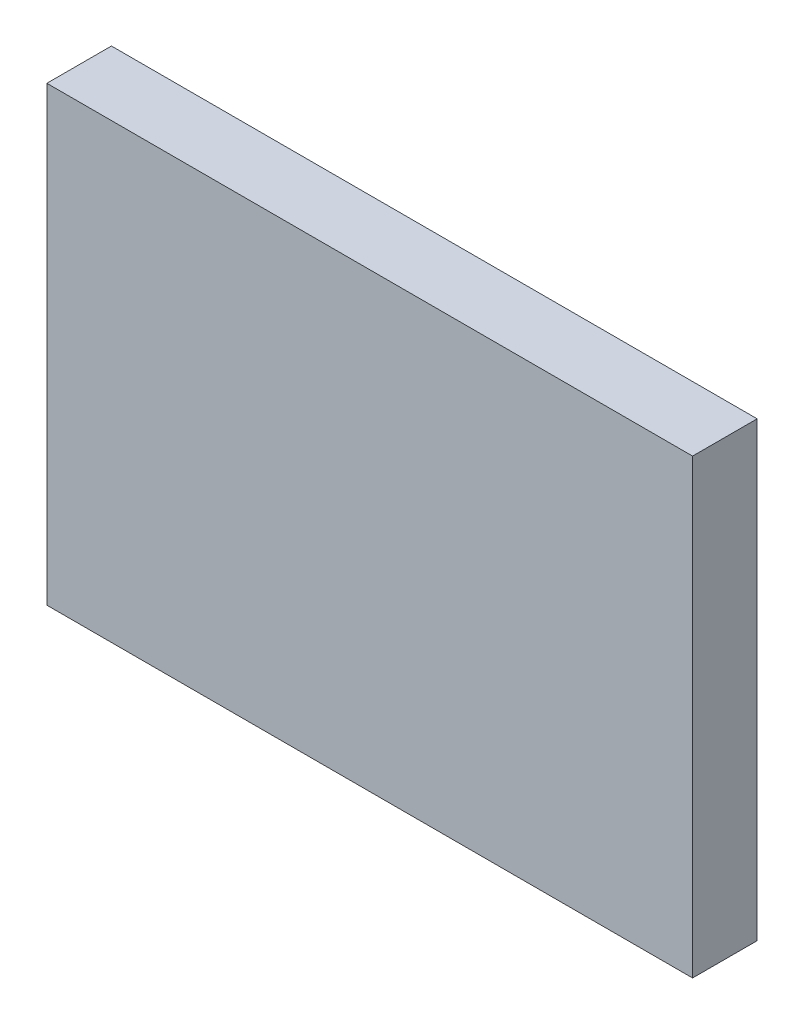
ISO-10303-21;
HEADER;
FILE_DESCRIPTION(('STEP AP214'),'2;1');
FILE_NAME('part.step','',(''),(''),'','','');
FILE_SCHEMA(('AUTOMOTIVE_DESIGN { 1 0 10303 214 1 1 1 1 }'));
ENDSEC;
DATA;
#1=APPLICATION_CONTEXT('core data for automotive mechanical design processes');
#2=APPLICATION_PROTOCOL_DEFINITION('international standard','automotive_design',2000,#1);
#3=PRODUCT_CONTEXT('',#1,'mechanical');
#4=PRODUCT('Part','Part','',(#3));
#5=PRODUCT_RELATED_PRODUCT_CATEGORY('part','',(#4));
#6=PRODUCT_DEFINITION_FORMATION('','',#4);
#7=PRODUCT_DEFINITION_CONTEXT('part definition',#1,'design');
#8=PRODUCT_DEFINITION('design','',#6,#7);
#9=PRODUCT_DEFINITION_SHAPE('','',#8);
#10=(LENGTH_UNIT() NAMED_UNIT(*) SI_UNIT(.MILLI.,.METRE.));
#11=(NAMED_UNIT(*) PLANE_ANGLE_UNIT() SI_UNIT($,.RADIAN.));
#12=(NAMED_UNIT(*) SI_UNIT($,.STERADIAN.) SOLID_ANGLE_UNIT());
#13=UNCERTAINTY_MEASURE_WITH_UNIT(LENGTH_MEASURE(1.E-05),#10,'distance_accuracy_value','');
#14=(GEOMETRIC_REPRESENTATION_CONTEXT(3) GLOBAL_UNCERTAINTY_ASSIGNED_CONTEXT((#13)) GLOBAL_UNIT_ASSIGNED_CONTEXT((#10,
#11,#12)) REPRESENTATION_CONTEXT('',''));
#15=CARTESIAN_POINT('',(0.,0.,0.));
#16=DIRECTION('',(0.,0.,1.));
#17=DIRECTION('',(1.,0.,0.));
#18=AXIS2_PLACEMENT_3D('',#15,#16,#17);
#19=CARTESIAN_POINT('',(0.,0.,10.));
#20=DIRECTION('',(0.,1.,0.));
#21=DIRECTION('',(0.,0.,1.));
#22=AXIS2_PLACEMENT_3D('',#19,#20,#21);
#23=PLANE('',#22);
#24=DIRECTION('',(1.,0.,0.));
#25=VECTOR('',#24,1.);
#26=CARTESIAN_POINT('',(0.,0.,0.));
#27=LINE('',#26,#25);
#28=CARTESIAN_POINT('',(0.,0.,0.));
#29=VERTEX_POINT('',#28);
#30=CARTESIAN_POINT('',(100.,0.,0.));
#31=VERTEX_POINT('',#30);
#32=EDGE_CURVE('E111',#29,#31,#27,.T.);
#33=ORIENTED_EDGE('',*,*,#32,.T.);
#34=DIRECTION('',(0.,0.,-1.));
#35=VECTOR('',#34,1.);
#36=CARTESIAN_POINT('',(100.,0.,10.));
#37=LINE('',#36,#35);
#38=CARTESIAN_POINT('',(100.,0.,10.));
#39=VERTEX_POINT('',#38);
#40=EDGE_CURVE('E11',#39,#31,#37,.T.);
#41=ORIENTED_EDGE('',*,*,#40,.F.);
#42=DIRECTION('',(1.,0.,0.));
#43=VECTOR('',#42,1.);
#44=CARTESIAN_POINT('',(0.,0.,10.));
#45=LINE('',#44,#43);
#46=CARTESIAN_POINT('',(0.,0.,10.));
#47=VERTEX_POINT('',#46);
#48=EDGE_CURVE('E93',#47,#39,#45,.T.);
#49=ORIENTED_EDGE('',*,*,#48,.F.);
#50=DIRECTION('',(0.,0.,-1.));
#51=VECTOR('',#50,1.);
#52=CARTESIAN_POINT('',(0.,0.,10.));
#53=LINE('',#52,#51);
#54=EDGE_CURVE('E60',#47,#29,#53,.T.);
#55=ORIENTED_EDGE('',*,*,#54,.T.);
#56=EDGE_LOOP('',(#33,#41,#49,#55));
#57=FACE_BOUND('',#56,.T.);
#58=ADVANCED_FACE('F43',(#57),#23,.F.);
#59=CARTESIAN_POINT('',(100.,0.,10.));
#60=DIRECTION('',(-1.,0.,0.));
#61=DIRECTION('',(0.,-1.,0.));
#62=AXIS2_PLACEMENT_3D('',#59,#60,#61);
#63=PLANE('',#62);
#64=DIRECTION('',(0.,1.,0.));
#65=VECTOR('',#64,1.);
#66=CARTESIAN_POINT('',(100.,0.,0.));
#67=LINE('',#66,#65);
#68=CARTESIAN_POINT('',(100.,70.,0.));
#69=VERTEX_POINT('',#68);
#70=EDGE_CURVE('E99',#31,#69,#67,.T.);
#71=ORIENTED_EDGE('',*,*,#70,.T.);
#72=DIRECTION('',(0.,0.,-1.));
#73=VECTOR('',#72,1.);
#74=CARTESIAN_POINT('',(100.,70.,10.));
#75=LINE('',#74,#73);
#76=CARTESIAN_POINT('',(100.,70.,10.));
#77=VERTEX_POINT('',#76);
#78=EDGE_CURVE('E52',#77,#69,#75,.T.);
#79=ORIENTED_EDGE('',*,*,#78,.F.);
#80=DIRECTION('',(0.,1.,0.));
#81=VECTOR('',#80,1.);
#82=CARTESIAN_POINT('',(100.,0.,10.));
#83=LINE('',#82,#81);
#84=EDGE_CURVE('E85',#39,#77,#83,.T.);
#85=ORIENTED_EDGE('',*,*,#84,.F.);
#86=ORIENTED_EDGE('',*,*,#40,.T.);
#87=EDGE_LOOP('',(#71,#79,#85,#86));
#88=FACE_BOUND('',#87,.T.);
#89=ADVANCED_FACE('F98',(#88),#63,.F.);
#90=CARTESIAN_POINT('',(0.,70.,10.));
#91=DIRECTION('',(0.,1.,0.));
#92=DIRECTION('',(0.,0.,1.));
#93=AXIS2_PLACEMENT_3D('',#90,#91,#92);
#94=PLANE('',#93);
#95=DIRECTION('',(1.,0.,0.));
#96=VECTOR('',#95,1.);
#97=CARTESIAN_POINT('',(0.,70.,0.));
#98=LINE('',#97,#96);
#99=CARTESIAN_POINT('',(0.,70.,0.));
#100=VERTEX_POINT('',#99);
#101=EDGE_CURVE('E116',#100,#69,#98,.T.);
#102=ORIENTED_EDGE('',*,*,#101,.F.);
#103=DIRECTION('',(0.,0.,-1.));
#104=VECTOR('',#103,1.);
#105=CARTESIAN_POINT('',(0.,70.,10.));
#106=LINE('',#105,#104);
#107=CARTESIAN_POINT('',(0.,70.,10.));
#108=VERTEX_POINT('',#107);
#109=EDGE_CURVE('E74',#108,#100,#106,.T.);
#110=ORIENTED_EDGE('',*,*,#109,.F.);
#111=DIRECTION('',(1.,0.,0.));
#112=VECTOR('',#111,1.);
#113=CARTESIAN_POINT('',(0.,70.,10.));
#114=LINE('',#113,#112);
#115=EDGE_CURVE('E92',#108,#77,#114,.T.);
#116=ORIENTED_EDGE('',*,*,#115,.T.);
#117=ORIENTED_EDGE('',*,*,#78,.T.);
#118=EDGE_LOOP('',(#102,#110,#116,#117));
#119=FACE_BOUND('',#118,.T.);
#120=ADVANCED_FACE('F103',(#119),#94,.T.);
#121=CARTESIAN_POINT('',(0.,0.,10.));
#122=DIRECTION('',(-1.,0.,0.));
#123=DIRECTION('',(0.,-1.,0.));
#124=AXIS2_PLACEMENT_3D('',#121,#122,#123);
#125=PLANE('',#124);
#126=DIRECTION('',(0.,1.,0.));
#127=VECTOR('',#126,1.);
#128=CARTESIAN_POINT('',(0.,0.,0.));
#129=LINE('',#128,#127);
#130=EDGE_CURVE('E119',#29,#100,#129,.T.);
#131=ORIENTED_EDGE('',*,*,#130,.F.);
#132=ORIENTED_EDGE('',*,*,#54,.F.);
#133=DIRECTION('',(0.,1.,0.));
#134=VECTOR('',#133,1.);
#135=CARTESIAN_POINT('',(0.,0.,10.));
#136=LINE('',#135,#134);
#137=EDGE_CURVE('E105',#47,#108,#136,.T.);
#138=ORIENTED_EDGE('',*,*,#137,.T.);
#139=ORIENTED_EDGE('',*,*,#109,.T.);
#140=EDGE_LOOP('',(#131,#132,#138,#139));
#141=FACE_BOUND('',#140,.T.);
#142=ADVANCED_FACE('F129',(#141),#125,.T.);
#143=CARTESIAN_POINT('',(0.,0.,10.));
#144=DIRECTION('',(0.,0.,1.));
#145=DIRECTION('',(1.,0.,0.));
#146=AXIS2_PLACEMENT_3D('',#143,#144,#145);
#147=PLANE('',#146);
#148=ORIENTED_EDGE('',*,*,#48,.T.);
#149=ORIENTED_EDGE('',*,*,#84,.T.);
#150=ORIENTED_EDGE('',*,*,#115,.F.);
#151=ORIENTED_EDGE('',*,*,#137,.F.);
#152=EDGE_LOOP('',(#148,#149,#150,#151));
#153=FACE_BOUND('',#152,.T.);
#154=ADVANCED_FACE('F89',(#153),#147,.T.);
#155=CARTESIAN_POINT('',(0.,0.,0.));
#156=DIRECTION('',(0.,0.,1.));
#157=DIRECTION('',(1.,0.,0.));
#158=AXIS2_PLACEMENT_3D('',#155,#156,#157);
#159=PLANE('',#158);
#160=ORIENTED_EDGE('',*,*,#32,.F.);
#161=ORIENTED_EDGE('',*,*,#130,.T.);
#162=ORIENTED_EDGE('',*,*,#101,.T.);
#163=ORIENTED_EDGE('',*,*,#70,.F.);
#164=EDGE_LOOP('',(#160,#161,#162,#163));
#165=FACE_BOUND('',#164,.T.);
#166=ADVANCED_FACE('F128',(#165),#159,.F.);
#167=CLOSED_SHELL('',(#58,#89,#120,#142,#154,#166));
#168=MANIFOLD_SOLID_BREP('B2',#167);
#169=ADVANCED_BREP_SHAPE_REPRESENTATION('',(#18,#168),#14);
#170=SHAPE_DEFINITION_REPRESENTATION(#9,#169);
ENDSEC;
END-ISO-10303-21;
